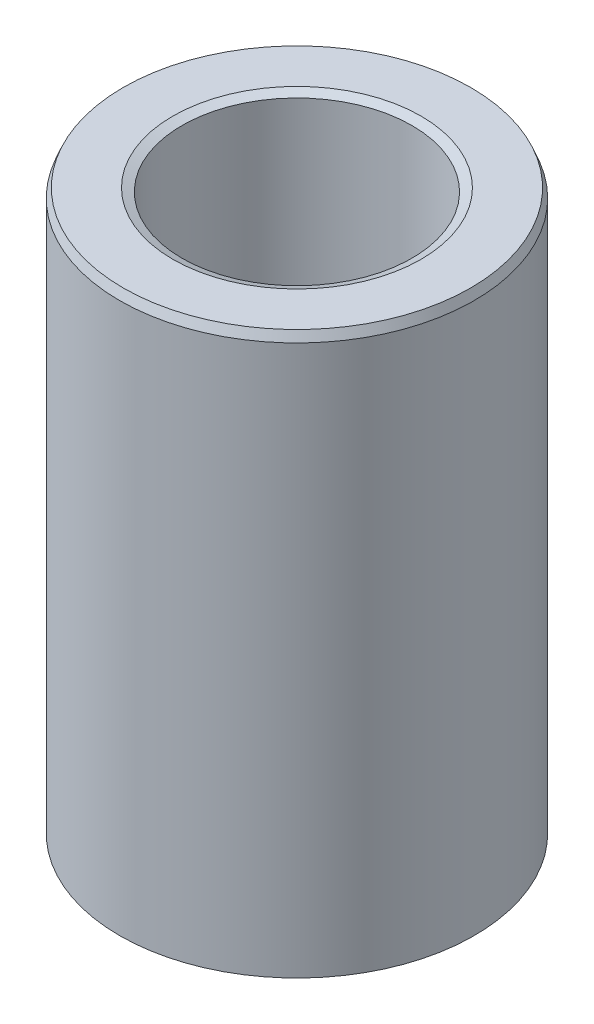
ISO-10303-21;
HEADER;
FILE_DESCRIPTION(('STEP AP214'),'2;1');
FILE_NAME('part.step','',(''),(''),'','','');
FILE_SCHEMA(('AUTOMOTIVE_DESIGN { 1 0 10303 214 1 1 1 1 }'));
ENDSEC;
DATA;
#1=APPLICATION_CONTEXT('core data for automotive mechanical design processes');
#2=APPLICATION_PROTOCOL_DEFINITION('international standard','automotive_design',2000,#1);
#3=PRODUCT_CONTEXT('',#1,'mechanical');
#4=PRODUCT('Part','Part','',(#3));
#5=PRODUCT_RELATED_PRODUCT_CATEGORY('part','',(#4));
#6=PRODUCT_DEFINITION_FORMATION('','',#4);
#7=PRODUCT_DEFINITION_CONTEXT('part definition',#1,'design');
#8=PRODUCT_DEFINITION('design','',#6,#7);
#9=PRODUCT_DEFINITION_SHAPE('','',#8);
#10=(LENGTH_UNIT() NAMED_UNIT(*) SI_UNIT(.MILLI.,.METRE.));
#11=(NAMED_UNIT(*) PLANE_ANGLE_UNIT() SI_UNIT($,.RADIAN.));
#12=(NAMED_UNIT(*) SI_UNIT($,.STERADIAN.) SOLID_ANGLE_UNIT());
#13=UNCERTAINTY_MEASURE_WITH_UNIT(LENGTH_MEASURE(1.E-05),#10,'distance_accuracy_value','');
#14=(GEOMETRIC_REPRESENTATION_CONTEXT(3) GLOBAL_UNCERTAINTY_ASSIGNED_CONTEXT((#13)) GLOBAL_UNIT_ASSIGNED_CONTEXT((#10,
#11,#12)) REPRESENTATION_CONTEXT('',''));
#15=CARTESIAN_POINT('',(0.,0.,0.));
#16=DIRECTION('',(0.,0.,1.));
#17=DIRECTION('',(1.,0.,0.));
#18=AXIS2_PLACEMENT_3D('',#15,#16,#17);
#19=CARTESIAN_POINT('',(0.,111.079061327451,0.));
#20=DIRECTION('',(0.,-1.,0.));
#21=DIRECTION('',(0.,0.,-1.));
#22=AXIS2_PLACEMENT_3D('',#19,#20,#21);
#23=CYLINDRICAL_SURFACE('',#22,35.);
#24=CARTESIAN_POINT('',(0.,0.71078072500505,0.));
#25=DIRECTION('',(0.,1.,0.));
#26=DIRECTION('',(0.,0.,1.));
#27=AXIS2_PLACEMENT_3D('',#24,#25,#26);
#28=CIRCLE('',#27,35.);
#29=CARTESIAN_POINT('',(0.,0.71078072500505,35.));
#30=VERTEX_POINT('',#29);
#31=EDGE_CURVE('E10',#30,#30,#28,.T.);
#32=ORIENTED_EDGE('',*,*,#31,.T.);
#33=EDGE_LOOP('',(#32));
#34=FACE_BOUND('',#33,.T.);
#35=CARTESIAN_POINT('',(0.,109.282212920076,0.));
#36=DIRECTION('',(0.,1.,0.));
#37=DIRECTION('',(0.,0.,1.));
#38=AXIS2_PLACEMENT_3D('',#35,#36,#37);
#39=CIRCLE('',#38,35.);
#40=CARTESIAN_POINT('',(0.,109.282212920076,35.));
#41=VERTEX_POINT('',#40);
#42=EDGE_CURVE('E50',#41,#41,#39,.F.);
#43=ORIENTED_EDGE('',*,*,#42,.T.);
#44=EDGE_LOOP('',(#43));
#45=FACE_BOUND('',#44,.T.);
#46=ADVANCED_FACE('F39',(#34,#45),#23,.T.);
#47=CARTESIAN_POINT('',(0.,111.079061327451,0.));
#48=DIRECTION('',(0.,1.,0.));
#49=DIRECTION('',(0.,0.,1.));
#50=AXIS2_PLACEMENT_3D('',#47,#48,#49);
#51=PLANE('',#50);
#52=CARTESIAN_POINT('',(0.,111.079061327451,0.));
#53=DIRECTION('',(0.,1.,0.));
#54=DIRECTION('',(0.,0.,1.));
#55=AXIS2_PLACEMENT_3D('',#52,#53,#54);
#56=CIRCLE('',#55,24.4958124255303);
#57=CARTESIAN_POINT('',(0.,111.079061327451,24.4958124255303));
#58=VERTEX_POINT('',#57);
#59=EDGE_CURVE('E58',#58,#58,#56,.F.);
#60=ORIENTED_EDGE('',*,*,#59,.T.);
#61=EDGE_LOOP('',(#60));
#62=FACE_BOUND('',#61,.T.);
#63=CARTESIAN_POINT('',(0.,111.079061327451,0.));
#64=DIRECTION('',(0.,1.,0.));
#65=DIRECTION('',(0.,0.,1.));
#66=AXIS2_PLACEMENT_3D('',#63,#64,#65);
#67=CIRCLE('',#66,34.289219274995);
#68=CARTESIAN_POINT('',(0.,111.079061327451,34.289219274995));
#69=VERTEX_POINT('',#68);
#70=EDGE_CURVE('E61',#69,#69,#67,.T.);
#71=ORIENTED_EDGE('',*,*,#70,.T.);
#72=EDGE_LOOP('',(#71));
#73=FACE_BOUND('',#72,.T.);
#74=ADVANCED_FACE('F88',(#62,#73),#51,.T.);
#75=CARTESIAN_POINT('',(0.,0.,0.));
#76=DIRECTION('',(0.,1.,0.));
#77=DIRECTION('',(0.,0.,1.));
#78=AXIS2_PLACEMENT_3D('',#75,#76,#77);
#79=PLANE('',#78);
#80=CARTESIAN_POINT('',(0.,0.,0.));
#81=DIRECTION('',(0.,1.,0.));
#82=DIRECTION('',(0.,0.,1.));
#83=AXIS2_PLACEMENT_3D('',#80,#81,#82);
#84=CIRCLE('',#83,23.4097447431601);
#85=CARTESIAN_POINT('',(0.,0.,23.4097447431601));
#86=VERTEX_POINT('',#85);
#87=EDGE_CURVE('E51',#86,#86,#84,.T.);
#88=ORIENTED_EDGE('',*,*,#87,.T.);
#89=EDGE_LOOP('',(#88));
#90=FACE_BOUND('',#89,.T.);
#91=CARTESIAN_POINT('',(0.,0.,0.));
#92=DIRECTION('',(0.,1.,0.));
#93=DIRECTION('',(0.,0.,1.));
#94=AXIS2_PLACEMENT_3D('',#91,#92,#93);
#95=CIRCLE('',#94,33.2031515926248);
#96=CARTESIAN_POINT('',(0.,0.,33.2031515926248));
#97=VERTEX_POINT('',#96);
#98=EDGE_CURVE('E54',#97,#97,#95,.F.);
#99=ORIENTED_EDGE('',*,*,#98,.T.);
#100=EDGE_LOOP('',(#99));
#101=FACE_BOUND('',#100,.T.);
#102=ADVANCED_FACE('F83',(#90,#101),#79,.F.);
#103=CARTESIAN_POINT('',(0.,111.079061327451,0.));
#104=DIRECTION('',(0.,-1.,0.));
#105=DIRECTION('',(0.,0.,-1.));
#106=AXIS2_PLACEMENT_3D('',#103,#104,#105);
#107=CYLINDRICAL_SURFACE('',#106,22.6989640181551);
#108=CARTESIAN_POINT('',(0.,110.368280602446,0.));
#109=DIRECTION('',(0.,1.,0.));
#110=DIRECTION('',(0.,0.,1.));
#111=AXIS2_PLACEMENT_3D('',#108,#109,#110);
#112=CIRCLE('',#111,22.6989640181551);
#113=CARTESIAN_POINT('',(0.,110.368280602446,22.6989640181551));
#114=VERTEX_POINT('',#113);
#115=EDGE_CURVE('E67',#114,#114,#112,.T.);
#116=ORIENTED_EDGE('',*,*,#115,.T.);
#117=EDGE_LOOP('',(#116));
#118=FACE_BOUND('',#117,.T.);
#119=CARTESIAN_POINT('',(0.,1.79684840737525,0.));
#120=DIRECTION('',(0.,1.,0.));
#121=DIRECTION('',(0.,0.,1.));
#122=AXIS2_PLACEMENT_3D('',#119,#120,#121);
#123=CIRCLE('',#122,22.6989640181551);
#124=CARTESIAN_POINT('',(0.,1.79684840737525,22.6989640181551));
#125=VERTEX_POINT('',#124);
#126=EDGE_CURVE('E69',#125,#125,#123,.F.);
#127=ORIENTED_EDGE('',*,*,#126,.T.);
#128=EDGE_LOOP('',(#127));
#129=FACE_BOUND('',#128,.T.);
#130=ADVANCED_FACE('F71',(#118,#129),#107,.F.);
#131=CARTESIAN_POINT('',(0.,110.368280602446,0.));
#132=DIRECTION('',(0.,1.,0.));
#133=DIRECTION('',(0.,0.,1.));
#134=AXIS2_PLACEMENT_3D('',#131,#132,#133);
#135=CONICAL_SURFACE('',#134,22.6989640181551,1.19411406531171);
#136=ORIENTED_EDGE('',*,*,#59,.F.);
#137=EDGE_LOOP('',(#136));
#138=FACE_BOUND('',#137,.T.);
#139=ORIENTED_EDGE('',*,*,#115,.F.);
#140=EDGE_LOOP('',(#139));
#141=FACE_BOUND('',#140,.T.);
#142=ADVANCED_FACE('F77',(#138,#141),#135,.F.);
#143=CARTESIAN_POINT('',(0.,0.,0.));
#144=DIRECTION('',(0.,-1.,0.));
#145=DIRECTION('',(0.,0.,-1.));
#146=AXIS2_PLACEMENT_3D('',#143,#144,#145);
#147=CONICAL_SURFACE('',#146,23.4097447431601,0.376682261483187);
#148=ORIENTED_EDGE('',*,*,#126,.F.);
#149=EDGE_LOOP('',(#148));
#150=FACE_BOUND('',#149,.T.);
#151=ORIENTED_EDGE('',*,*,#87,.F.);
#152=EDGE_LOOP('',(#151));
#153=FACE_BOUND('',#152,.T.);
#154=ADVANCED_FACE('F73',(#150,#153),#147,.F.);
#155=CARTESIAN_POINT('',(0.,0.71078072500505,0.));
#156=DIRECTION('',(0.,1.,0.));
#157=DIRECTION('',(0.,0.,1.));
#158=AXIS2_PLACEMENT_3D('',#155,#156,#157);
#159=CONICAL_SURFACE('',#158,35.,1.19411406531171);
#160=ORIENTED_EDGE('',*,*,#98,.F.);
#161=EDGE_LOOP('',(#160));
#162=FACE_BOUND('',#161,.T.);
#163=ORIENTED_EDGE('',*,*,#31,.F.);
#164=EDGE_LOOP('',(#163));
#165=FACE_BOUND('',#164,.T.);
#166=ADVANCED_FACE('F76',(#162,#165),#159,.T.);
#167=CARTESIAN_POINT('',(0.,111.079061327451,0.));
#168=DIRECTION('',(0.,-1.,0.));
#169=DIRECTION('',(0.,0.,-1.));
#170=AXIS2_PLACEMENT_3D('',#167,#168,#169);
#171=CONICAL_SURFACE('',#170,34.289219274995,0.376682261483184);
#172=ORIENTED_EDGE('',*,*,#42,.F.);
#173=EDGE_LOOP('',(#172));
#174=FACE_BOUND('',#173,.T.);
#175=ORIENTED_EDGE('',*,*,#70,.F.);
#176=EDGE_LOOP('',(#175));
#177=FACE_BOUND('',#176,.T.);
#178=ADVANCED_FACE('F45',(#174,#177),#171,.T.);
#179=CLOSED_SHELL('',(#46,#74,#102,#130,#142,#154,#166,#178));
#180=MANIFOLD_SOLID_BREP('B2',#179);
#181=ADVANCED_BREP_SHAPE_REPRESENTATION('',(#18,#180),#14);
#182=SHAPE_DEFINITION_REPRESENTATION(#9,#181);
ENDSEC;
END-ISO-10303-21;
